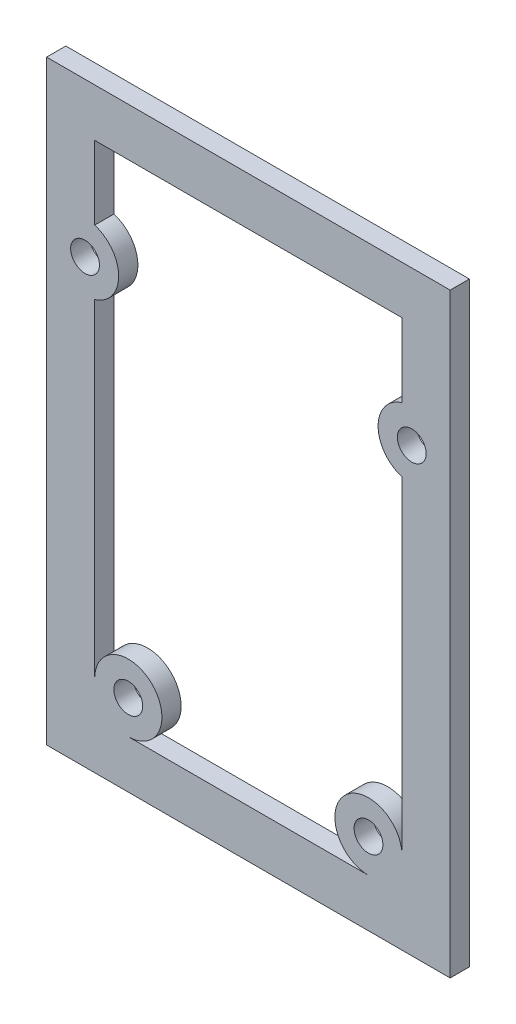
ISO-10303-21;
HEADER;
FILE_DESCRIPTION(('STEP AP214'),'2;1');
FILE_NAME('part.step','',(''),(''),'','','');
FILE_SCHEMA(('AUTOMOTIVE_DESIGN { 1 0 10303 214 1 1 1 1 }'));
ENDSEC;
DATA;
#1=APPLICATION_CONTEXT('core data for automotive mechanical design processes');
#2=APPLICATION_PROTOCOL_DEFINITION('international standard','automotive_design',2000,#1);
#3=PRODUCT_CONTEXT('',#1,'mechanical');
#4=PRODUCT('Part','Part','',(#3));
#5=PRODUCT_RELATED_PRODUCT_CATEGORY('part','',(#4));
#6=PRODUCT_DEFINITION_FORMATION('','',#4);
#7=PRODUCT_DEFINITION_CONTEXT('part definition',#1,'design');
#8=PRODUCT_DEFINITION('design','',#6,#7);
#9=PRODUCT_DEFINITION_SHAPE('','',#8);
#10=(LENGTH_UNIT() NAMED_UNIT(*) SI_UNIT(.MILLI.,.METRE.));
#11=(NAMED_UNIT(*) PLANE_ANGLE_UNIT() SI_UNIT($,.RADIAN.));
#12=(NAMED_UNIT(*) SI_UNIT($,.STERADIAN.) SOLID_ANGLE_UNIT());
#13=UNCERTAINTY_MEASURE_WITH_UNIT(LENGTH_MEASURE(1.E-05),#10,'distance_accuracy_value','');
#14=(GEOMETRIC_REPRESENTATION_CONTEXT(3) GLOBAL_UNCERTAINTY_ASSIGNED_CONTEXT((#13)) GLOBAL_UNIT_ASSIGNED_CONTEXT((#10,
#11,#12)) REPRESENTATION_CONTEXT('',''));
#15=CARTESIAN_POINT('',(0.,0.,0.));
#16=DIRECTION('',(0.,0.,1.));
#17=DIRECTION('',(1.,0.,0.));
#18=AXIS2_PLACEMENT_3D('',#15,#16,#17);
#19=CARTESIAN_POINT('',(-39.6015162961093,0.,2.));
#20=DIRECTION('',(1.,0.,0.));
#21=DIRECTION('',(0.,1.,0.));
#22=AXIS2_PLACEMENT_3D('',#19,#20,#21);
#23=PLANE('',#22);
#24=DIRECTION('',(0.,-1.,0.));
#25=VECTOR('',#24,1.);
#26=CARTESIAN_POINT('',(-39.6015162961093,0.,0.));
#27=LINE('',#26,#25);
#28=CARTESIAN_POINT('',(-39.6015162961093,-26.,0.));
#29=VERTEX_POINT('',#28);
#30=CARTESIAN_POINT('',(-39.6015162961093,-88.,0.));
#31=VERTEX_POINT('',#30);
#32=EDGE_CURVE('E221',#29,#31,#27,.T.);
#33=ORIENTED_EDGE('',*,*,#32,.F.);
#34=DIRECTION('',(0.,0.,-1.));
#35=VECTOR('',#34,1.);
#36=CARTESIAN_POINT('',(-39.6015162961093,-26.,2.));
#37=LINE('',#36,#35);
#38=CARTESIAN_POINT('',(-39.6015162961093,-26.,2.));
#39=VERTEX_POINT('',#38);
#40=EDGE_CURVE('E11',#39,#29,#37,.T.);
#41=ORIENTED_EDGE('',*,*,#40,.F.);
#42=DIRECTION('',(0.,-1.,0.));
#43=VECTOR('',#42,1.);
#44=CARTESIAN_POINT('',(-39.6015162961093,0.,2.));
#45=LINE('',#44,#43);
#46=CARTESIAN_POINT('',(-39.6015162961093,-88.,2.));
#47=VERTEX_POINT('',#46);
#48=EDGE_CURVE('E172',#39,#47,#45,.T.);
#49=ORIENTED_EDGE('',*,*,#48,.T.);
#50=DIRECTION('',(0.,0.,-1.));
#51=VECTOR('',#50,1.);
#52=CARTESIAN_POINT('',(-39.6015162961093,-88.,2.));
#53=LINE('',#52,#51);
#54=EDGE_CURVE('E115',#47,#31,#53,.T.);
#55=ORIENTED_EDGE('',*,*,#54,.T.);
#56=EDGE_LOOP('',(#33,#41,#49,#55));
#57=FACE_BOUND('',#56,.T.);
#58=ADVANCED_FACE('F43',(#57),#23,.T.);
#59=CARTESIAN_POINT('',(0.,-26.,2.));
#60=DIRECTION('',(0.,1.,0.));
#61=DIRECTION('',(-1.,0.,0.));
#62=AXIS2_PLACEMENT_3D('',#59,#60,#61);
#63=PLANE('',#62);
#64=DIRECTION('',(1.,0.,0.));
#65=VECTOR('',#64,1.);
#66=CARTESIAN_POINT('',(0.,-26.,0.));
#67=LINE('',#66,#65);
#68=CARTESIAN_POINT('',(-81.6015162961093,-26.,0.));
#69=VERTEX_POINT('',#68);
#70=EDGE_CURVE('E161',#69,#29,#67,.T.);
#71=ORIENTED_EDGE('',*,*,#70,.F.);
#72=DIRECTION('',(0.,0.,-1.));
#73=VECTOR('',#72,1.);
#74=CARTESIAN_POINT('',(-81.6015162961093,-26.,2.));
#75=LINE('',#74,#73);
#76=CARTESIAN_POINT('',(-81.6015162961093,-26.,2.));
#77=VERTEX_POINT('',#76);
#78=EDGE_CURVE('E53',#77,#69,#75,.T.);
#79=ORIENTED_EDGE('',*,*,#78,.F.);
#80=DIRECTION('',(1.,0.,0.));
#81=VECTOR('',#80,1.);
#82=CARTESIAN_POINT('',(0.,-26.,2.));
#83=LINE('',#82,#81);
#84=EDGE_CURVE('E159',#77,#39,#83,.T.);
#85=ORIENTED_EDGE('',*,*,#84,.T.);
#86=ORIENTED_EDGE('',*,*,#40,.T.);
#87=EDGE_LOOP('',(#71,#79,#85,#86));
#88=FACE_BOUND('',#87,.T.);
#89=ADVANCED_FACE('F157',(#88),#63,.T.);
#90=CARTESIAN_POINT('',(-81.6015162961093,0.,2.));
#91=DIRECTION('',(1.,0.,0.));
#92=DIRECTION('',(0.,1.,0.));
#93=AXIS2_PLACEMENT_3D('',#90,#91,#92);
#94=PLANE('',#93);
#95=DIRECTION('',(0.,-1.,0.));
#96=VECTOR('',#95,1.);
#97=CARTESIAN_POINT('',(-81.6015162961093,0.,0.));
#98=LINE('',#97,#96);
#99=CARTESIAN_POINT('',(-81.6015162961093,-88.,0.));
#100=VERTEX_POINT('',#99);
#101=EDGE_CURVE('E224',#69,#100,#98,.T.);
#102=ORIENTED_EDGE('',*,*,#101,.T.);
#103=DIRECTION('',(0.,0.,-1.));
#104=VECTOR('',#103,1.);
#105=CARTESIAN_POINT('',(-81.6015162961093,-88.,2.));
#106=LINE('',#105,#104);
#107=CARTESIAN_POINT('',(-81.6015162961093,-88.,2.));
#108=VERTEX_POINT('',#107);
#109=EDGE_CURVE('E164',#108,#100,#106,.T.);
#110=ORIENTED_EDGE('',*,*,#109,.F.);
#111=DIRECTION('',(0.,-1.,0.));
#112=VECTOR('',#111,1.);
#113=CARTESIAN_POINT('',(-81.6015162961093,0.,2.));
#114=LINE('',#113,#112);
#115=EDGE_CURVE('E167',#77,#108,#114,.T.);
#116=ORIENTED_EDGE('',*,*,#115,.F.);
#117=ORIENTED_EDGE('',*,*,#78,.T.);
#118=EDGE_LOOP('',(#102,#110,#116,#117));
#119=FACE_BOUND('',#118,.T.);
#120=ADVANCED_FACE('F168',(#119),#94,.F.);
#121=CARTESIAN_POINT('',(-43.6015162961095,-42.0000000000006,2.));
#122=DIRECTION('',(0.,0.,-1.));
#123=DIRECTION('',(-1.,0.,0.));
#124=AXIS2_PLACEMENT_3D('',#121,#122,#123);
#125=CYLINDRICAL_SURFACE('',#124,3.5);
#126=CARTESIAN_POINT('',(-43.6015162961095,-42.0000000000006,0.));
#127=DIRECTION('',(0.,0.,1.));
#128=DIRECTION('',(1.,0.,0.));
#129=AXIS2_PLACEMENT_3D('',#126,#127,#128);
#130=CIRCLE('',#129,3.5);
#131=CARTESIAN_POINT('',(-44.6015162961093,-45.3541019662503,0.));
#132=VERTEX_POINT('',#131);
#133=CARTESIAN_POINT('',(-44.6015162961093,-38.6458980337508,0.));
#134=VERTEX_POINT('',#133);
#135=EDGE_CURVE('E192',#132,#134,#130,.F.);
#136=ORIENTED_EDGE('',*,*,#135,.F.);
#137=DIRECTION('',(0.,0.,-1.));
#138=VECTOR('',#137,1.);
#139=CARTESIAN_POINT('',(-44.6015162961093,-45.3541019662503,2.));
#140=LINE('',#139,#138);
#141=CARTESIAN_POINT('',(-44.6015162961093,-45.3541019662503,2.));
#142=VERTEX_POINT('',#141);
#143=EDGE_CURVE('E47',#142,#132,#140,.T.);
#144=ORIENTED_EDGE('',*,*,#143,.F.);
#145=CARTESIAN_POINT('',(-43.6015162961095,-42.0000000000006,2.));
#146=DIRECTION('',(0.,0.,1.));
#147=DIRECTION('',(1.,0.,0.));
#148=AXIS2_PLACEMENT_3D('',#145,#146,#147);
#149=CIRCLE('',#148,3.5);
#150=CARTESIAN_POINT('',(-44.6015162961093,-38.6458980337508,2.));
#151=VERTEX_POINT('',#150);
#152=EDGE_CURVE('E239',#142,#151,#149,.F.);
#153=ORIENTED_EDGE('',*,*,#152,.T.);
#154=DIRECTION('',(0.,0.,-1.));
#155=VECTOR('',#154,1.);
#156=CARTESIAN_POINT('',(-44.6015162961093,-38.6458980337508,2.));
#157=LINE('',#156,#155);
#158=EDGE_CURVE('E191',#151,#134,#157,.T.);
#159=ORIENTED_EDGE('',*,*,#158,.T.);
#160=EDGE_LOOP('',(#136,#144,#153,#159));
#161=FACE_BOUND('',#160,.T.);
#162=ADVANCED_FACE('F45',(#161),#125,.T.);
#163=CARTESIAN_POINT('',(-44.6015162961093,0.,2.));
#164=DIRECTION('',(1.,0.,0.));
#165=DIRECTION('',(0.,0.,-1.));
#166=AXIS2_PLACEMENT_3D('',#163,#164,#165);
#167=PLANE('',#166);
#168=DIRECTION('',(0.,-1.,0.));
#169=VECTOR('',#168,1.);
#170=CARTESIAN_POINT('',(-44.6015162961093,0.,0.));
#171=LINE('',#170,#169);
#172=CARTESIAN_POINT('',(-44.6015162961093,-79.5,0.));
#173=VERTEX_POINT('',#172);
#174=EDGE_CURVE('E195',#132,#173,#171,.T.);
#175=ORIENTED_EDGE('',*,*,#174,.T.);
#176=DIRECTION('',(0.,0.,-1.));
#177=VECTOR('',#176,1.);
#178=CARTESIAN_POINT('',(-44.6015162961093,-79.5,2.));
#179=LINE('',#178,#177);
#180=CARTESIAN_POINT('',(-44.6015162961093,-79.5,2.));
#181=VERTEX_POINT('',#180);
#182=EDGE_CURVE('E257',#181,#173,#179,.T.);
#183=ORIENTED_EDGE('',*,*,#182,.F.);
#184=DIRECTION('',(0.,-1.,0.));
#185=VECTOR('',#184,1.);
#186=CARTESIAN_POINT('',(-44.6015162961093,0.,2.));
#187=LINE('',#186,#185);
#188=EDGE_CURVE('E265',#142,#181,#187,.T.);
#189=ORIENTED_EDGE('',*,*,#188,.F.);
#190=ORIENTED_EDGE('',*,*,#143,.T.);
#191=EDGE_LOOP('',(#175,#183,#189,#190));
#192=FACE_BOUND('',#191,.T.);
#193=ADVANCED_FACE('F264',(#192),#167,.F.);
#194=CARTESIAN_POINT('',(-48.1015162961093,-79.5,2.));
#195=DIRECTION('',(0.,0.,-1.));
#196=DIRECTION('',(-1.,0.,0.));
#197=AXIS2_PLACEMENT_3D('',#194,#195,#196);
#198=CYLINDRICAL_SURFACE('',#197,3.49999999999999);
#199=CARTESIAN_POINT('',(-48.1015162961093,-79.5,0.));
#200=DIRECTION('',(0.,0.,1.));
#201=DIRECTION('',(1.,0.,0.));
#202=AXIS2_PLACEMENT_3D('',#199,#200,#201);
#203=CIRCLE('',#202,3.49999999999999);
#204=CARTESIAN_POINT('',(-48.1015162961093,-83.,0.));
#205=VERTEX_POINT('',#204);
#206=EDGE_CURVE('E198',#205,#173,#203,.F.);
#207=ORIENTED_EDGE('',*,*,#206,.F.);
#208=DIRECTION('',(0.,0.,-1.));
#209=VECTOR('',#208,1.);
#210=CARTESIAN_POINT('',(-48.1015162961093,-83.,2.));
#211=LINE('',#210,#209);
#212=CARTESIAN_POINT('',(-48.1015162961093,-83.,2.));
#213=VERTEX_POINT('',#212);
#214=EDGE_CURVE('E256',#213,#205,#211,.T.);
#215=ORIENTED_EDGE('',*,*,#214,.F.);
#216=CARTESIAN_POINT('',(-48.1015162961093,-79.5,2.));
#217=DIRECTION('',(0.,0.,1.));
#218=DIRECTION('',(1.,0.,0.));
#219=AXIS2_PLACEMENT_3D('',#216,#217,#218);
#220=CIRCLE('',#219,3.49999999999999);
#221=EDGE_CURVE('E533',#213,#181,#220,.F.);
#222=ORIENTED_EDGE('',*,*,#221,.T.);
#223=ORIENTED_EDGE('',*,*,#182,.T.);
#224=EDGE_LOOP('',(#207,#215,#222,#223));
#225=FACE_BOUND('',#224,.T.);
#226=ADVANCED_FACE('F307',(#225),#198,.T.);
#227=CARTESIAN_POINT('',(0.,-83.,2.));
#228=DIRECTION('',(0.,1.,0.));
#229=DIRECTION('',(0.,0.,1.));
#230=AXIS2_PLACEMENT_3D('',#227,#228,#229);
#231=PLANE('',#230);
#232=DIRECTION('',(1.,0.,0.));
#233=VECTOR('',#232,1.);
#234=CARTESIAN_POINT('',(0.,-83.,0.));
#235=LINE('',#234,#233);
#236=CARTESIAN_POINT('',(-73.1015162961093,-83.,0.));
#237=VERTEX_POINT('',#236);
#238=EDGE_CURVE('E201',#237,#205,#235,.T.);
#239=ORIENTED_EDGE('',*,*,#238,.F.);
#240=DIRECTION('',(0.,0.,-1.));
#241=VECTOR('',#240,1.);
#242=CARTESIAN_POINT('',(-73.1015162961093,-83.,2.));
#243=LINE('',#242,#241);
#244=CARTESIAN_POINT('',(-73.1015162961093,-83.,2.));
#245=VERTEX_POINT('',#244);
#246=EDGE_CURVE('E254',#245,#237,#243,.T.);
#247=ORIENTED_EDGE('',*,*,#246,.F.);
#248=DIRECTION('',(1.,0.,0.));
#249=VECTOR('',#248,1.);
#250=CARTESIAN_POINT('',(0.,-83.,2.));
#251=LINE('',#250,#249);
#252=EDGE_CURVE('E305',#245,#213,#251,.T.);
#253=ORIENTED_EDGE('',*,*,#252,.T.);
#254=ORIENTED_EDGE('',*,*,#214,.T.);
#255=EDGE_LOOP('',(#239,#247,#253,#254));
#256=FACE_BOUND('',#255,.T.);
#257=ADVANCED_FACE('F302',(#256),#231,.T.);
#258=CARTESIAN_POINT('',(-73.1015162961093,-79.5,2.));
#259=DIRECTION('',(0.,0.,-1.));
#260=DIRECTION('',(-1.,0.,0.));
#261=AXIS2_PLACEMENT_3D('',#258,#259,#260);
#262=CYLINDRICAL_SURFACE('',#261,3.50000000000001);
#263=CARTESIAN_POINT('',(-73.1015162961093,-79.5,0.));
#264=DIRECTION('',(0.,0.,1.));
#265=DIRECTION('',(1.,0.,0.));
#266=AXIS2_PLACEMENT_3D('',#263,#264,#265);
#267=CIRCLE('',#266,3.50000000000001);
#268=CARTESIAN_POINT('',(-76.6015162961093,-79.5,0.));
#269=VERTEX_POINT('',#268);
#270=EDGE_CURVE('E204',#237,#269,#267,.T.);
#271=ORIENTED_EDGE('',*,*,#270,.T.);
#272=DIRECTION('',(0.,0.,-1.));
#273=VECTOR('',#272,1.);
#274=CARTESIAN_POINT('',(-76.6015162961093,-79.5,2.));
#275=LINE('',#274,#273);
#276=CARTESIAN_POINT('',(-76.6015162961093,-79.5,2.));
#277=VERTEX_POINT('',#276);
#278=EDGE_CURVE('E252',#277,#269,#275,.T.);
#279=ORIENTED_EDGE('',*,*,#278,.F.);
#280=CARTESIAN_POINT('',(-73.1015162961093,-79.5,2.));
#281=DIRECTION('',(0.,0.,1.));
#282=DIRECTION('',(1.,0.,0.));
#283=AXIS2_PLACEMENT_3D('',#280,#281,#282);
#284=CIRCLE('',#283,3.50000000000001);
#285=EDGE_CURVE('E538',#245,#277,#284,.T.);
#286=ORIENTED_EDGE('',*,*,#285,.F.);
#287=ORIENTED_EDGE('',*,*,#246,.T.);
#288=EDGE_LOOP('',(#271,#279,#286,#287));
#289=FACE_BOUND('',#288,.T.);
#290=ADVANCED_FACE('F299',(#289),#262,.T.);
#291=CARTESIAN_POINT('',(-76.6015162961094,0.,2.));
#292=DIRECTION('',(1.,0.,0.));
#293=DIRECTION('',(0.,1.,0.));
#294=AXIS2_PLACEMENT_3D('',#291,#292,#293);
#295=PLANE('',#294);
#296=DIRECTION('',(0.,-1.,0.));
#297=VECTOR('',#296,1.);
#298=CARTESIAN_POINT('',(-76.6015162961094,0.,0.));
#299=LINE('',#298,#297);
#300=CARTESIAN_POINT('',(-76.6015162961093,-45.3541019662503,0.));
#301=VERTEX_POINT('',#300);
#302=EDGE_CURVE('E207',#301,#269,#299,.T.);
#303=ORIENTED_EDGE('',*,*,#302,.F.);
#304=DIRECTION('',(0.,0.,-1.));
#305=VECTOR('',#304,1.);
#306=CARTESIAN_POINT('',(-76.6015162961093,-45.3541019662503,2.));
#307=LINE('',#306,#305);
#308=CARTESIAN_POINT('',(-76.6015162961093,-45.3541019662503,2.));
#309=VERTEX_POINT('',#308);
#310=EDGE_CURVE('E250',#309,#301,#307,.T.);
#311=ORIENTED_EDGE('',*,*,#310,.F.);
#312=DIRECTION('',(0.,-1.,0.));
#313=VECTOR('',#312,1.);
#314=CARTESIAN_POINT('',(-76.6015162961094,0.,2.));
#315=LINE('',#314,#313);
#316=EDGE_CURVE('E296',#309,#277,#315,.T.);
#317=ORIENTED_EDGE('',*,*,#316,.T.);
#318=ORIENTED_EDGE('',*,*,#278,.T.);
#319=EDGE_LOOP('',(#303,#311,#317,#318));
#320=FACE_BOUND('',#319,.T.);
#321=ADVANCED_FACE('F292',(#320),#295,.T.);
#322=CARTESIAN_POINT('',(-77.6015162961093,-42.,2.));
#323=DIRECTION('',(0.,0.,-1.));
#324=DIRECTION('',(-1.,0.,0.));
#325=AXIS2_PLACEMENT_3D('',#322,#323,#324);
#326=CYLINDRICAL_SURFACE('',#325,3.50000000000005);
#327=CARTESIAN_POINT('',(-77.6015162961093,-42.,0.));
#328=DIRECTION('',(0.,0.,1.));
#329=DIRECTION('',(1.,0.,0.));
#330=AXIS2_PLACEMENT_3D('',#327,#328,#329);
#331=CIRCLE('',#330,3.50000000000005);
#332=CARTESIAN_POINT('',(-76.6015162961093,-38.6458980337508,0.));
#333=VERTEX_POINT('',#332);
#334=EDGE_CURVE('E210',#301,#333,#331,.T.);
#335=ORIENTED_EDGE('',*,*,#334,.T.);
#336=DIRECTION('',(0.,0.,-1.));
#337=VECTOR('',#336,1.);
#338=CARTESIAN_POINT('',(-76.6015162961093,-38.6458980337508,2.));
#339=LINE('',#338,#337);
#340=CARTESIAN_POINT('',(-76.6015162961093,-38.6458980337508,2.));
#341=VERTEX_POINT('',#340);
#342=EDGE_CURVE('E248',#341,#333,#339,.T.);
#343=ORIENTED_EDGE('',*,*,#342,.F.);
#344=CARTESIAN_POINT('',(-77.6015162961093,-42.,2.));
#345=DIRECTION('',(0.,0.,1.));
#346=DIRECTION('',(1.,0.,0.));
#347=AXIS2_PLACEMENT_3D('',#344,#345,#346);
#348=CIRCLE('',#347,3.50000000000005);
#349=EDGE_CURVE('E541',#309,#341,#348,.T.);
#350=ORIENTED_EDGE('',*,*,#349,.F.);
#351=ORIENTED_EDGE('',*,*,#310,.T.);
#352=EDGE_LOOP('',(#335,#343,#350,#351));
#353=FACE_BOUND('',#352,.T.);
#354=ADVANCED_FACE('F288',(#353),#326,.T.);
#355=CARTESIAN_POINT('',(-76.6015162961093,1.39036589844862E-13,2.));
#356=DIRECTION('',(1.,0.,0.));
#357=DIRECTION('',(0.,1.,0.));
#358=AXIS2_PLACEMENT_3D('',#355,#356,#357);
#359=PLANE('',#358);
#360=DIRECTION('',(0.,-1.,0.));
#361=VECTOR('',#360,1.);
#362=CARTESIAN_POINT('',(-76.6015162961093,1.39036589844862E-13,0.));
#363=LINE('',#362,#361);
#364=CARTESIAN_POINT('',(-76.6015162961093,-31.,0.));
#365=VERTEX_POINT('',#364);
#366=EDGE_CURVE('E213',#365,#333,#363,.T.);
#367=ORIENTED_EDGE('',*,*,#366,.F.);
#368=DIRECTION('',(0.,0.,-1.));
#369=VECTOR('',#368,1.);
#370=CARTESIAN_POINT('',(-76.6015162961093,-31.,2.));
#371=LINE('',#370,#369);
#372=CARTESIAN_POINT('',(-76.6015162961093,-31.,2.));
#373=VERTEX_POINT('',#372);
#374=EDGE_CURVE('E246',#373,#365,#371,.T.);
#375=ORIENTED_EDGE('',*,*,#374,.F.);
#376=DIRECTION('',(0.,-1.,0.));
#377=VECTOR('',#376,1.);
#378=CARTESIAN_POINT('',(-76.6015162961093,1.39036589844862E-13,2.));
#379=LINE('',#378,#377);
#380=EDGE_CURVE('E285',#373,#341,#379,.T.);
#381=ORIENTED_EDGE('',*,*,#380,.T.);
#382=ORIENTED_EDGE('',*,*,#342,.T.);
#383=EDGE_LOOP('',(#367,#375,#381,#382));
#384=FACE_BOUND('',#383,.T.);
#385=ADVANCED_FACE('F280',(#384),#359,.T.);
#386=CARTESIAN_POINT('',(0.,-31.,2.));
#387=DIRECTION('',(0.,1.,0.));
#388=DIRECTION('',(0.,0.,1.));
#389=AXIS2_PLACEMENT_3D('',#386,#387,#388);
#390=PLANE('',#389);
#391=DIRECTION('',(1.,0.,0.));
#392=VECTOR('',#391,1.);
#393=CARTESIAN_POINT('',(0.,-31.,0.));
#394=LINE('',#393,#392);
#395=CARTESIAN_POINT('',(-44.6015162961093,-31.,0.));
#396=VERTEX_POINT('',#395);
#397=EDGE_CURVE('E216',#365,#396,#394,.T.);
#398=ORIENTED_EDGE('',*,*,#397,.T.);
#399=DIRECTION('',(0.,0.,-1.));
#400=VECTOR('',#399,1.);
#401=CARTESIAN_POINT('',(-44.6015162961093,-31.,2.));
#402=LINE('',#401,#400);
#403=CARTESIAN_POINT('',(-44.6015162961093,-31.,2.));
#404=VERTEX_POINT('',#403);
#405=EDGE_CURVE('E243',#404,#396,#402,.T.);
#406=ORIENTED_EDGE('',*,*,#405,.F.);
#407=DIRECTION('',(1.,0.,0.));
#408=VECTOR('',#407,1.);
#409=CARTESIAN_POINT('',(0.,-31.,2.));
#410=LINE('',#409,#408);
#411=EDGE_CURVE('E544',#373,#404,#410,.T.);
#412=ORIENTED_EDGE('',*,*,#411,.F.);
#413=ORIENTED_EDGE('',*,*,#374,.T.);
#414=EDGE_LOOP('',(#398,#406,#412,#413));
#415=FACE_BOUND('',#414,.T.);
#416=ADVANCED_FACE('F327',(#415),#390,.F.);
#417=CARTESIAN_POINT('',(-43.6015162961093,-42.,2.));
#418=DIRECTION('',(0.,0.,-1.));
#419=DIRECTION('',(-1.,0.,0.));
#420=AXIS2_PLACEMENT_3D('',#417,#418,#419);
#421=CYLINDRICAL_SURFACE('',#420,1.5);
#422=CARTESIAN_POINT('',(-43.6015162961093,-42.,2.));
#423=DIRECTION('',(0.,0.,1.));
#424=DIRECTION('',(1.,0.,0.));
#425=AXIS2_PLACEMENT_3D('',#422,#423,#424);
#426=CIRCLE('',#425,1.5);
#427=CARTESIAN_POINT('',(-42.1015162961093,-42.,2.));
#428=VERTEX_POINT('',#427);
#429=EDGE_CURVE('E185',#428,#428,#426,.F.);
#430=ORIENTED_EDGE('',*,*,#429,.F.);
#431=EDGE_LOOP('',(#430));
#432=FACE_BOUND('',#431,.T.);
#433=CARTESIAN_POINT('',(-43.6015162961093,-42.,0.));
#434=DIRECTION('',(0.,0.,1.));
#435=DIRECTION('',(1.,0.,0.));
#436=AXIS2_PLACEMENT_3D('',#433,#434,#435);
#437=CIRCLE('',#436,1.5);
#438=CARTESIAN_POINT('',(-42.1015162961093,-42.,0.));
#439=VERTEX_POINT('',#438);
#440=EDGE_CURVE('E233',#439,#439,#437,.F.);
#441=ORIENTED_EDGE('',*,*,#440,.T.);
#442=EDGE_LOOP('',(#441));
#443=FACE_BOUND('',#442,.T.);
#444=ADVANCED_FACE('F330',(#432,#443),#421,.F.);
#445=CARTESIAN_POINT('',(-77.6015162961093,-42.,2.));
#446=DIRECTION('',(0.,0.,-1.));
#447=DIRECTION('',(-1.,0.,0.));
#448=AXIS2_PLACEMENT_3D('',#445,#446,#447);
#449=CYLINDRICAL_SURFACE('',#448,1.5);
#450=CARTESIAN_POINT('',(-77.6015162961093,-42.,2.));
#451=DIRECTION('',(0.,0.,1.));
#452=DIRECTION('',(1.,0.,0.));
#453=AXIS2_PLACEMENT_3D('',#450,#451,#452);
#454=CIRCLE('',#453,1.5);
#455=CARTESIAN_POINT('',(-76.1015162961093,-42.,2.));
#456=VERTEX_POINT('',#455);
#457=EDGE_CURVE('E182',#456,#456,#454,.T.);
#458=ORIENTED_EDGE('',*,*,#457,.T.);
#459=EDGE_LOOP('',(#458));
#460=FACE_BOUND('',#459,.T.);
#461=CARTESIAN_POINT('',(-77.6015162961093,-42.,0.));
#462=DIRECTION('',(0.,0.,1.));
#463=DIRECTION('',(1.,0.,0.));
#464=AXIS2_PLACEMENT_3D('',#461,#462,#463);
#465=CIRCLE('',#464,1.5);
#466=CARTESIAN_POINT('',(-76.1015162961093,-42.,0.));
#467=VERTEX_POINT('',#466);
#468=EDGE_CURVE('E230',#467,#467,#465,.T.);
#469=ORIENTED_EDGE('',*,*,#468,.F.);
#470=EDGE_LOOP('',(#469));
#471=FACE_BOUND('',#470,.T.);
#472=ADVANCED_FACE('F369',(#460,#471),#449,.F.);
#473=CARTESIAN_POINT('',(-73.1015162961093,-79.5,2.));
#474=DIRECTION('',(0.,0.,-1.));
#475=DIRECTION('',(-1.,0.,0.));
#476=AXIS2_PLACEMENT_3D('',#473,#474,#475);
#477=CYLINDRICAL_SURFACE('',#476,1.5);
#478=CARTESIAN_POINT('',(-73.1015162961093,-79.5,2.));
#479=DIRECTION('',(0.,0.,1.));
#480=DIRECTION('',(1.,0.,0.));
#481=AXIS2_PLACEMENT_3D('',#478,#479,#480);
#482=CIRCLE('',#481,1.5);
#483=CARTESIAN_POINT('',(-71.6015162961093,-79.5,2.));
#484=VERTEX_POINT('',#483);
#485=EDGE_CURVE('E179',#484,#484,#482,.T.);
#486=ORIENTED_EDGE('',*,*,#485,.T.);
#487=EDGE_LOOP('',(#486));
#488=FACE_BOUND('',#487,.T.);
#489=CARTESIAN_POINT('',(-73.1015162961093,-79.5,0.));
#490=DIRECTION('',(0.,0.,1.));
#491=DIRECTION('',(1.,0.,0.));
#492=AXIS2_PLACEMENT_3D('',#489,#490,#491);
#493=CIRCLE('',#492,1.5);
#494=CARTESIAN_POINT('',(-71.6015162961093,-79.5,0.));
#495=VERTEX_POINT('',#494);
#496=EDGE_CURVE('E227',#495,#495,#493,.T.);
#497=ORIENTED_EDGE('',*,*,#496,.F.);
#498=EDGE_LOOP('',(#497));
#499=FACE_BOUND('',#498,.T.);
#500=ADVANCED_FACE('F378',(#488,#499),#477,.F.);
#501=CARTESIAN_POINT('',(0.,-88.,2.));
#502=DIRECTION('',(0.,1.,0.));
#503=DIRECTION('',(-1.,0.,0.));
#504=AXIS2_PLACEMENT_3D('',#501,#502,#503);
#505=PLANE('',#504);
#506=DIRECTION('',(1.,0.,0.));
#507=VECTOR('',#506,1.);
#508=CARTESIAN_POINT('',(0.,-88.,0.));
#509=LINE('',#508,#507);
#510=EDGE_CURVE('E108',#100,#31,#509,.T.);
#511=ORIENTED_EDGE('',*,*,#510,.T.);
#512=ORIENTED_EDGE('',*,*,#54,.F.);
#513=DIRECTION('',(1.,0.,0.));
#514=VECTOR('',#513,1.);
#515=CARTESIAN_POINT('',(0.,-88.,2.));
#516=LINE('',#515,#514);
#517=EDGE_CURVE('E62',#108,#47,#516,.T.);
#518=ORIENTED_EDGE('',*,*,#517,.F.);
#519=ORIENTED_EDGE('',*,*,#109,.T.);
#520=EDGE_LOOP('',(#511,#512,#518,#519));
#521=FACE_BOUND('',#520,.T.);
#522=ADVANCED_FACE('F326',(#521),#505,.F.);
#523=CARTESIAN_POINT('',(-44.6015162961093,0.,2.));
#524=DIRECTION('',(1.,0.,0.));
#525=DIRECTION('',(0.,1.,0.));
#526=AXIS2_PLACEMENT_3D('',#523,#524,#525);
#527=PLANE('',#526);
#528=DIRECTION('',(0.,-1.,0.));
#529=VECTOR('',#528,1.);
#530=CARTESIAN_POINT('',(-44.6015162961093,0.,0.));
#531=LINE('',#530,#529);
#532=EDGE_CURVE('E218',#396,#134,#531,.T.);
#533=ORIENTED_EDGE('',*,*,#532,.T.);
#534=ORIENTED_EDGE('',*,*,#158,.F.);
#535=DIRECTION('',(0.,-1.,0.));
#536=VECTOR('',#535,1.);
#537=CARTESIAN_POINT('',(-44.6015162961093,0.,2.));
#538=LINE('',#537,#536);
#539=EDGE_CURVE('E174',#404,#151,#538,.T.);
#540=ORIENTED_EDGE('',*,*,#539,.F.);
#541=ORIENTED_EDGE('',*,*,#405,.T.);
#542=EDGE_LOOP('',(#533,#534,#540,#541));
#543=FACE_BOUND('',#542,.T.);
#544=ADVANCED_FACE('F273',(#543),#527,.F.);
#545=CARTESIAN_POINT('',(-48.1015162961093,-79.5,2.));
#546=DIRECTION('',(0.,0.,-1.));
#547=DIRECTION('',(-1.,0.,0.));
#548=AXIS2_PLACEMENT_3D('',#545,#546,#547);
#549=CYLINDRICAL_SURFACE('',#548,1.5);
#550=CARTESIAN_POINT('',(-48.1015162961093,-79.5,2.));
#551=DIRECTION('',(0.,0.,1.));
#552=DIRECTION('',(1.,0.,0.));
#553=AXIS2_PLACEMENT_3D('',#550,#551,#552);
#554=CIRCLE('',#553,1.5);
#555=CARTESIAN_POINT('',(-46.6015162961093,-79.5,2.));
#556=VERTEX_POINT('',#555);
#557=EDGE_CURVE('E188',#556,#556,#554,.F.);
#558=ORIENTED_EDGE('',*,*,#557,.F.);
#559=EDGE_LOOP('',(#558));
#560=FACE_BOUND('',#559,.T.);
#561=CARTESIAN_POINT('',(-48.1015162961093,-79.5,0.));
#562=DIRECTION('',(0.,0.,1.));
#563=DIRECTION('',(1.,0.,0.));
#564=AXIS2_PLACEMENT_3D('',#561,#562,#563);
#565=CIRCLE('',#564,1.5);
#566=CARTESIAN_POINT('',(-46.6015162961093,-79.5,0.));
#567=VERTEX_POINT('',#566);
#568=EDGE_CURVE('E236',#567,#567,#565,.F.);
#569=ORIENTED_EDGE('',*,*,#568,.T.);
#570=EDGE_LOOP('',(#569));
#571=FACE_BOUND('',#570,.T.);
#572=ADVANCED_FACE('F325',(#560,#571),#549,.F.);
#573=CARTESIAN_POINT('',(0.,0.,2.));
#574=DIRECTION('',(0.,0.,1.));
#575=DIRECTION('',(1.,0.,0.));
#576=AXIS2_PLACEMENT_3D('',#573,#574,#575);
#577=PLANE('',#576);
#578=ORIENTED_EDGE('',*,*,#152,.F.);
#579=ORIENTED_EDGE('',*,*,#188,.T.);
#580=ORIENTED_EDGE('',*,*,#221,.F.);
#581=ORIENTED_EDGE('',*,*,#252,.F.);
#582=ORIENTED_EDGE('',*,*,#285,.T.);
#583=ORIENTED_EDGE('',*,*,#316,.F.);
#584=ORIENTED_EDGE('',*,*,#349,.T.);
#585=ORIENTED_EDGE('',*,*,#380,.F.);
#586=ORIENTED_EDGE('',*,*,#411,.T.);
#587=ORIENTED_EDGE('',*,*,#539,.T.);
#588=EDGE_LOOP('',(#578,#579,#580,#581,#582,#583,#584,#585,#586,#587));
#589=FACE_BOUND('',#588,.T.);
#590=ORIENTED_EDGE('',*,*,#48,.F.);
#591=ORIENTED_EDGE('',*,*,#84,.F.);
#592=ORIENTED_EDGE('',*,*,#115,.T.);
#593=ORIENTED_EDGE('',*,*,#517,.T.);
#594=EDGE_LOOP('',(#590,#591,#592,#593));
#595=FACE_BOUND('',#594,.T.);
#596=ORIENTED_EDGE('',*,*,#485,.F.);
#597=EDGE_LOOP('',(#596));
#598=FACE_BOUND('',#597,.T.);
#599=ORIENTED_EDGE('',*,*,#457,.F.);
#600=EDGE_LOOP('',(#599));
#601=FACE_BOUND('',#600,.T.);
#602=ORIENTED_EDGE('',*,*,#429,.T.);
#603=EDGE_LOOP('',(#602));
#604=FACE_BOUND('',#603,.T.);
#605=ORIENTED_EDGE('',*,*,#557,.T.);
#606=EDGE_LOOP('',(#605));
#607=FACE_BOUND('',#606,.T.);
#608=ADVANCED_FACE('F170',(#589,#595,#598,#601,#604,#607),#577,.T.);
#609=CARTESIAN_POINT('',(0.,0.,0.));
#610=DIRECTION('',(0.,0.,1.));
#611=DIRECTION('',(1.,0.,0.));
#612=AXIS2_PLACEMENT_3D('',#609,#610,#611);
#613=PLANE('',#612);
#614=ORIENTED_EDGE('',*,*,#135,.T.);
#615=ORIENTED_EDGE('',*,*,#532,.F.);
#616=ORIENTED_EDGE('',*,*,#397,.F.);
#617=ORIENTED_EDGE('',*,*,#366,.T.);
#618=ORIENTED_EDGE('',*,*,#334,.F.);
#619=ORIENTED_EDGE('',*,*,#302,.T.);
#620=ORIENTED_EDGE('',*,*,#270,.F.);
#621=ORIENTED_EDGE('',*,*,#238,.T.);
#622=ORIENTED_EDGE('',*,*,#206,.T.);
#623=ORIENTED_EDGE('',*,*,#174,.F.);
#624=EDGE_LOOP('',(#614,#615,#616,#617,#618,#619,#620,#621,#622,#623));
#625=FACE_BOUND('',#624,.T.);
#626=ORIENTED_EDGE('',*,*,#32,.T.);
#627=ORIENTED_EDGE('',*,*,#510,.F.);
#628=ORIENTED_EDGE('',*,*,#101,.F.);
#629=ORIENTED_EDGE('',*,*,#70,.T.);
#630=EDGE_LOOP('',(#626,#627,#628,#629));
#631=FACE_BOUND('',#630,.T.);
#632=ORIENTED_EDGE('',*,*,#496,.T.);
#633=EDGE_LOOP('',(#632));
#634=FACE_BOUND('',#633,.T.);
#635=ORIENTED_EDGE('',*,*,#468,.T.);
#636=EDGE_LOOP('',(#635));
#637=FACE_BOUND('',#636,.T.);
#638=ORIENTED_EDGE('',*,*,#440,.F.);
#639=EDGE_LOOP('',(#638));
#640=FACE_BOUND('',#639,.T.);
#641=ORIENTED_EDGE('',*,*,#568,.F.);
#642=EDGE_LOOP('',(#641));
#643=FACE_BOUND('',#642,.T.);
#644=ADVANCED_FACE('F268',(#625,#631,#634,#637,#640,#643),#613,.F.);
#645=CLOSED_SHELL('',(#58,#89,#120,#162,#193,#226,#257,#290,#321,#354,#385,#416,#444,#472,#500,
#522,#544,#572,#608,#644));
#646=MANIFOLD_SOLID_BREP('B2',#645);
#647=ADVANCED_BREP_SHAPE_REPRESENTATION('',(#18,#646),#14);
#648=SHAPE_DEFINITION_REPRESENTATION(#9,#647);
ENDSEC;
END-ISO-10303-21;
